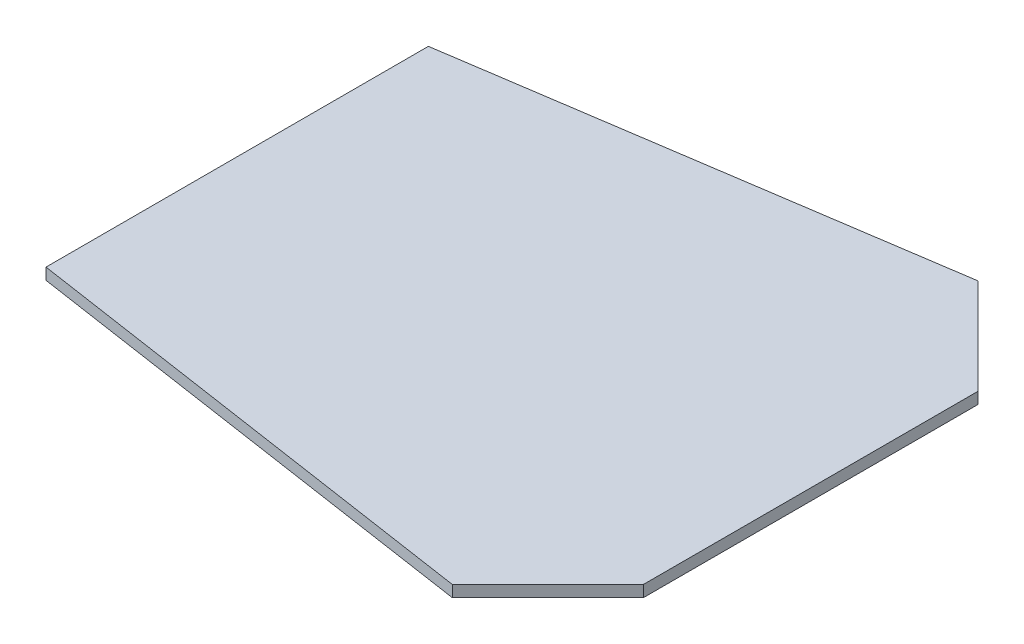
ISO-10303-21;
HEADER;
FILE_DESCRIPTION(('STEP AP214'),'2;1');
FILE_NAME('part.step','',(''),(''),'','','');
FILE_SCHEMA(('AUTOMOTIVE_DESIGN { 1 0 10303 214 1 1 1 1 }'));
ENDSEC;
DATA;
#1=APPLICATION_CONTEXT('core data for automotive mechanical design processes');
#2=APPLICATION_PROTOCOL_DEFINITION('international standard','automotive_design',2000,#1);
#3=PRODUCT_CONTEXT('',#1,'mechanical');
#4=PRODUCT('Part','Part','',(#3));
#5=PRODUCT_RELATED_PRODUCT_CATEGORY('part','',(#4));
#6=PRODUCT_DEFINITION_FORMATION('','',#4);
#7=PRODUCT_DEFINITION_CONTEXT('part definition',#1,'design');
#8=PRODUCT_DEFINITION('design','',#6,#7);
#9=PRODUCT_DEFINITION_SHAPE('','',#8);
#10=(LENGTH_UNIT() NAMED_UNIT(*) SI_UNIT(.MILLI.,.METRE.));
#11=(NAMED_UNIT(*) PLANE_ANGLE_UNIT() SI_UNIT($,.RADIAN.));
#12=(NAMED_UNIT(*) SI_UNIT($,.STERADIAN.) SOLID_ANGLE_UNIT());
#13=UNCERTAINTY_MEASURE_WITH_UNIT(LENGTH_MEASURE(1.E-05),#10,'distance_accuracy_value','');
#14=(GEOMETRIC_REPRESENTATION_CONTEXT(3) GLOBAL_UNCERTAINTY_ASSIGNED_CONTEXT((#13)) GLOBAL_UNIT_ASSIGNED_CONTEXT((#10,
#11,#12)) REPRESENTATION_CONTEXT('',''));
#15=CARTESIAN_POINT('',(0.,0.,0.));
#16=DIRECTION('',(0.,0.,1.));
#17=DIRECTION('',(1.,0.,0.));
#18=AXIS2_PLACEMENT_3D('',#15,#16,#17);
#19=CARTESIAN_POINT('',(500.,12.,75.));
#20=DIRECTION('',(0.148340452930245,0.,-0.988936352868298));
#21=DIRECTION('',(-0.988936352868298,0.,-0.148340452930245));
#22=AXIS2_PLACEMENT_3D('',#19,#20,#21);
#23=PLANE('',#22);
#24=DIRECTION('',(0.988936352868298,0.,0.148340452930245));
#25=VECTOR('',#24,1.);
#26=CARTESIAN_POINT('',(500.,0.,75.));
#27=LINE('',#26,#25);
#28=CARTESIAN_POINT('',(0.,0.,0.));
#29=VERTEX_POINT('',#28);
#30=CARTESIAN_POINT('',(500.,0.,75.));
#31=VERTEX_POINT('',#30);
#32=EDGE_CURVE('E116',#29,#31,#27,.T.);
#33=ORIENTED_EDGE('',*,*,#32,.T.);
#34=DIRECTION('',(0.,-1.,0.));
#35=VECTOR('',#34,1.);
#36=CARTESIAN_POINT('',(500.,12.,75.));
#37=LINE('',#36,#35);
#38=CARTESIAN_POINT('',(500.,12.,75.));
#39=VERTEX_POINT('',#38);
#40=EDGE_CURVE('E11',#39,#31,#37,.T.);
#41=ORIENTED_EDGE('',*,*,#40,.F.);
#42=DIRECTION('',(0.988936352868298,0.,0.148340452930245));
#43=VECTOR('',#42,1.);
#44=CARTESIAN_POINT('',(500.,12.,75.));
#45=LINE('',#44,#43);
#46=CARTESIAN_POINT('',(0.,12.,0.));
#47=VERTEX_POINT('',#46);
#48=EDGE_CURVE('E126',#47,#39,#45,.T.);
#49=ORIENTED_EDGE('',*,*,#48,.F.);
#50=DIRECTION('',(0.,-1.,0.));
#51=VECTOR('',#50,1.);
#52=CARTESIAN_POINT('',(0.,12.,0.));
#53=LINE('',#52,#51);
#54=EDGE_CURVE('E112',#47,#29,#53,.T.);
#55=ORIENTED_EDGE('',*,*,#54,.T.);
#56=EDGE_LOOP('',(#33,#41,#49,#55));
#57=FACE_BOUND('',#56,.T.);
#58=ADVANCED_FACE('F32',(#57),#23,.F.);
#59=CARTESIAN_POINT('',(600.,12.,-25.));
#60=DIRECTION('',(-0.707106781186548,0.,-0.707106781186547));
#61=DIRECTION('',(-0.707106781186547,0.,0.707106781186548));
#62=AXIS2_PLACEMENT_3D('',#59,#60,#61);
#63=PLANE('',#62);
#64=DIRECTION('',(0.707106781186547,0.,-0.707106781186548));
#65=VECTOR('',#64,1.);
#66=CARTESIAN_POINT('',(600.,0.,-25.));
#67=LINE('',#66,#65);
#68=CARTESIAN_POINT('',(600.,0.,-25.));
#69=VERTEX_POINT('',#68);
#70=EDGE_CURVE('E119',#31,#69,#67,.T.);
#71=ORIENTED_EDGE('',*,*,#70,.T.);
#72=DIRECTION('',(0.,-1.,0.));
#73=VECTOR('',#72,1.);
#74=CARTESIAN_POINT('',(600.,12.,-25.));
#75=LINE('',#74,#73);
#76=CARTESIAN_POINT('',(600.,12.,-25.));
#77=VERTEX_POINT('',#76);
#78=EDGE_CURVE('E40',#77,#69,#75,.T.);
#79=ORIENTED_EDGE('',*,*,#78,.F.);
#80=DIRECTION('',(0.707106781186547,0.,-0.707106781186548));
#81=VECTOR('',#80,1.);
#82=CARTESIAN_POINT('',(600.,12.,-25.));
#83=LINE('',#82,#81);
#84=EDGE_CURVE('E85',#39,#77,#83,.T.);
#85=ORIENTED_EDGE('',*,*,#84,.F.);
#86=ORIENTED_EDGE('',*,*,#40,.T.);
#87=EDGE_LOOP('',(#71,#79,#85,#86));
#88=FACE_BOUND('',#87,.T.);
#89=ADVANCED_FACE('F150',(#88),#63,.F.);
#90=CARTESIAN_POINT('',(600.,12.,-375.));
#91=DIRECTION('',(-1.,0.,0.));
#92=DIRECTION('',(0.,0.,1.));
#93=AXIS2_PLACEMENT_3D('',#90,#91,#92);
#94=PLANE('',#93);
#95=DIRECTION('',(0.,0.,-1.));
#96=VECTOR('',#95,1.);
#97=CARTESIAN_POINT('',(600.,0.,-375.));
#98=LINE('',#97,#96);
#99=CARTESIAN_POINT('',(600.,0.,-375.));
#100=VERTEX_POINT('',#99);
#101=EDGE_CURVE('E121',#69,#100,#98,.T.);
#102=ORIENTED_EDGE('',*,*,#101,.T.);
#103=DIRECTION('',(0.,-1.,0.));
#104=VECTOR('',#103,1.);
#105=CARTESIAN_POINT('',(600.,12.,-375.));
#106=LINE('',#105,#104);
#107=CARTESIAN_POINT('',(600.,12.,-375.));
#108=VERTEX_POINT('',#107);
#109=EDGE_CURVE('E107',#108,#100,#106,.T.);
#110=ORIENTED_EDGE('',*,*,#109,.F.);
#111=DIRECTION('',(0.,0.,-1.));
#112=VECTOR('',#111,1.);
#113=CARTESIAN_POINT('',(600.,12.,-375.));
#114=LINE('',#113,#112);
#115=EDGE_CURVE('E98',#77,#108,#114,.T.);
#116=ORIENTED_EDGE('',*,*,#115,.F.);
#117=ORIENTED_EDGE('',*,*,#78,.T.);
#118=EDGE_LOOP('',(#102,#110,#116,#117));
#119=FACE_BOUND('',#118,.T.);
#120=ADVANCED_FACE('F132',(#119),#94,.F.);
#121=CARTESIAN_POINT('',(500.,12.,-475.));
#122=DIRECTION('',(-0.707106781186548,0.,0.707106781186547));
#123=DIRECTION('',(0.707106781186547,0.,0.707106781186548));
#124=AXIS2_PLACEMENT_3D('',#121,#122,#123);
#125=PLANE('',#124);
#126=DIRECTION('',(-0.707106781186547,0.,-0.707106781186548));
#127=VECTOR('',#126,1.);
#128=CARTESIAN_POINT('',(500.,0.,-475.));
#129=LINE('',#128,#127);
#130=CARTESIAN_POINT('',(500.,0.,-475.));
#131=VERTEX_POINT('',#130);
#132=EDGE_CURVE('E106',#100,#131,#129,.T.);
#133=ORIENTED_EDGE('',*,*,#132,.T.);
#134=DIRECTION('',(0.,-1.,0.));
#135=VECTOR('',#134,1.);
#136=CARTESIAN_POINT('',(500.,12.,-475.));
#137=LINE('',#136,#135);
#138=CARTESIAN_POINT('',(500.,12.,-475.));
#139=VERTEX_POINT('',#138);
#140=EDGE_CURVE('E103',#139,#131,#137,.T.);
#141=ORIENTED_EDGE('',*,*,#140,.F.);
#142=DIRECTION('',(-0.707106781186547,0.,-0.707106781186548));
#143=VECTOR('',#142,1.);
#144=CARTESIAN_POINT('',(500.,12.,-475.));
#145=LINE('',#144,#143);
#146=EDGE_CURVE('E92',#108,#139,#145,.T.);
#147=ORIENTED_EDGE('',*,*,#146,.F.);
#148=ORIENTED_EDGE('',*,*,#109,.T.);
#149=EDGE_LOOP('',(#133,#141,#147,#148));
#150=FACE_BOUND('',#149,.T.);
#151=ADVANCED_FACE('F104',(#150),#125,.F.);
#152=CARTESIAN_POINT('',(0.,12.,-400.));
#153=DIRECTION('',(0.148340452930245,0.,0.988936352868298));
#154=DIRECTION('',(0.988936352868298,0.,-0.148340452930245));
#155=AXIS2_PLACEMENT_3D('',#152,#153,#154);
#156=PLANE('',#155);
#157=DIRECTION('',(-0.988936352868298,0.,0.148340452930245));
#158=VECTOR('',#157,1.);
#159=CARTESIAN_POINT('',(0.,0.,-400.));
#160=LINE('',#159,#158);
#161=CARTESIAN_POINT('',(0.,0.,-400.));
#162=VERTEX_POINT('',#161);
#163=EDGE_CURVE('E71',#131,#162,#160,.T.);
#164=ORIENTED_EDGE('',*,*,#163,.T.);
#165=DIRECTION('',(0.,-1.,0.));
#166=VECTOR('',#165,1.);
#167=CARTESIAN_POINT('',(0.,12.,-400.));
#168=LINE('',#167,#166);
#169=CARTESIAN_POINT('',(0.,12.,-400.));
#170=VERTEX_POINT('',#169);
#171=EDGE_CURVE('E108',#170,#162,#168,.T.);
#172=ORIENTED_EDGE('',*,*,#171,.F.);
#173=DIRECTION('',(-0.988936352868298,0.,0.148340452930245));
#174=VECTOR('',#173,1.);
#175=CARTESIAN_POINT('',(0.,12.,-400.));
#176=LINE('',#175,#174);
#177=EDGE_CURVE('E96',#139,#170,#176,.T.);
#178=ORIENTED_EDGE('',*,*,#177,.F.);
#179=ORIENTED_EDGE('',*,*,#140,.T.);
#180=EDGE_LOOP('',(#164,#172,#178,#179));
#181=FACE_BOUND('',#180,.T.);
#182=ADVANCED_FACE('F110',(#181),#156,.F.);
#183=CARTESIAN_POINT('',(0.,12.,0.));
#184=DIRECTION('',(1.,0.,0.));
#185=DIRECTION('',(0.,0.,-1.));
#186=AXIS2_PLACEMENT_3D('',#183,#184,#185);
#187=PLANE('',#186);
#188=DIRECTION('',(0.,0.,1.));
#189=VECTOR('',#188,1.);
#190=CARTESIAN_POINT('',(0.,0.,0.));
#191=LINE('',#190,#189);
#192=EDGE_CURVE('E77',#162,#29,#191,.T.);
#193=ORIENTED_EDGE('',*,*,#192,.T.);
#194=ORIENTED_EDGE('',*,*,#54,.F.);
#195=DIRECTION('',(0.,0.,1.));
#196=VECTOR('',#195,1.);
#197=CARTESIAN_POINT('',(0.,12.,0.));
#198=LINE('',#197,#196);
#199=EDGE_CURVE('E48',#170,#47,#198,.T.);
#200=ORIENTED_EDGE('',*,*,#199,.F.);
#201=ORIENTED_EDGE('',*,*,#171,.T.);
#202=EDGE_LOOP('',(#193,#194,#200,#201));
#203=FACE_BOUND('',#202,.T.);
#204=ADVANCED_FACE('F139',(#203),#187,.F.);
#205=CARTESIAN_POINT('',(0.,12.,0.));
#206=DIRECTION('',(0.,-1.,0.));
#207=DIRECTION('',(0.,0.,-1.));
#208=AXIS2_PLACEMENT_3D('',#205,#206,#207);
#209=PLANE('',#208);
#210=ORIENTED_EDGE('',*,*,#48,.T.);
#211=ORIENTED_EDGE('',*,*,#84,.T.);
#212=ORIENTED_EDGE('',*,*,#115,.T.);
#213=ORIENTED_EDGE('',*,*,#146,.T.);
#214=ORIENTED_EDGE('',*,*,#177,.T.);
#215=ORIENTED_EDGE('',*,*,#199,.T.);
#216=EDGE_LOOP('',(#210,#211,#212,#213,#214,#215));
#217=FACE_BOUND('',#216,.T.);
#218=ADVANCED_FACE('F94',(#217),#209,.F.);
#219=CARTESIAN_POINT('',(0.,0.,0.));
#220=DIRECTION('',(0.,-1.,0.));
#221=DIRECTION('',(0.,0.,-1.));
#222=AXIS2_PLACEMENT_3D('',#219,#220,#221);
#223=PLANE('',#222);
#224=ORIENTED_EDGE('',*,*,#32,.F.);
#225=ORIENTED_EDGE('',*,*,#192,.F.);
#226=ORIENTED_EDGE('',*,*,#163,.F.);
#227=ORIENTED_EDGE('',*,*,#132,.F.);
#228=ORIENTED_EDGE('',*,*,#101,.F.);
#229=ORIENTED_EDGE('',*,*,#70,.F.);
#230=EDGE_LOOP('',(#224,#225,#226,#227,#228,#229));
#231=FACE_BOUND('',#230,.T.);
#232=ADVANCED_FACE('F135',(#231),#223,.T.);
#233=CLOSED_SHELL('',(#58,#89,#120,#151,#182,#204,#218,#232));
#234=MANIFOLD_SOLID_BREP('B2',#233);
#235=ADVANCED_BREP_SHAPE_REPRESENTATION('',(#18,#234),#14);
#236=SHAPE_DEFINITION_REPRESENTATION(#9,#235);
ENDSEC;
END-ISO-10303-21;
